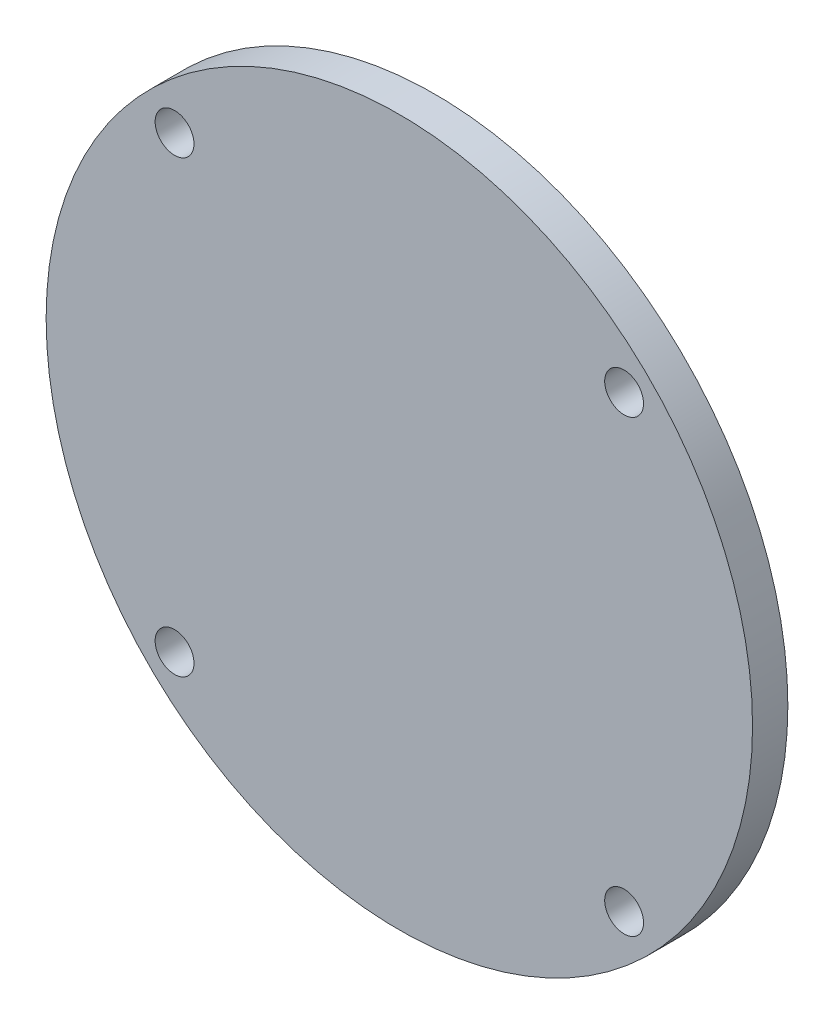
ISO-10303-21;
HEADER;
FILE_DESCRIPTION(('STEP AP214'),'2;1');
FILE_NAME('part.step','',(''),(''),'','','');
FILE_SCHEMA(('AUTOMOTIVE_DESIGN { 1 0 10303 214 1 1 1 1 }'));
ENDSEC;
DATA;
#1=APPLICATION_CONTEXT('core data for automotive mechanical design processes');
#2=APPLICATION_PROTOCOL_DEFINITION('international standard','automotive_design',2000,#1);
#3=PRODUCT_CONTEXT('',#1,'mechanical');
#4=PRODUCT('Part','Part','',(#3));
#5=PRODUCT_RELATED_PRODUCT_CATEGORY('part','',(#4));
#6=PRODUCT_DEFINITION_FORMATION('','',#4);
#7=PRODUCT_DEFINITION_CONTEXT('part definition',#1,'design');
#8=PRODUCT_DEFINITION('design','',#6,#7);
#9=PRODUCT_DEFINITION_SHAPE('','',#8);
#10=(LENGTH_UNIT() NAMED_UNIT(*) SI_UNIT(.MILLI.,.METRE.));
#11=(NAMED_UNIT(*) PLANE_ANGLE_UNIT() SI_UNIT($,.RADIAN.));
#12=(NAMED_UNIT(*) SI_UNIT($,.STERADIAN.) SOLID_ANGLE_UNIT());
#13=UNCERTAINTY_MEASURE_WITH_UNIT(LENGTH_MEASURE(1.E-05),#10,'distance_accuracy_value','');
#14=(GEOMETRIC_REPRESENTATION_CONTEXT(3) GLOBAL_UNCERTAINTY_ASSIGNED_CONTEXT((#13)) GLOBAL_UNIT_ASSIGNED_CONTEXT((#10,
#11,#12)) REPRESENTATION_CONTEXT('',''));
#15=CARTESIAN_POINT('',(0.,0.,0.));
#16=DIRECTION('',(0.,0.,1.));
#17=DIRECTION('',(1.,0.,0.));
#18=AXIS2_PLACEMENT_3D('',#15,#16,#17);
#19=CARTESIAN_POINT('',(0.,0.,-5.));
#20=DIRECTION('',(0.,0.,1.));
#21=DIRECTION('',(1.,0.,0.));
#22=AXIS2_PLACEMENT_3D('',#19,#20,#21);
#23=CYLINDRICAL_SURFACE('',#22,50.);
#24=CARTESIAN_POINT('',(0.,0.,-5.));
#25=DIRECTION('',(0.,0.,1.));
#26=DIRECTION('',(1.,0.,0.));
#27=AXIS2_PLACEMENT_3D('',#24,#25,#26);
#28=CIRCLE('',#27,50.);
#29=CARTESIAN_POINT('',(50.,0.,-5.));
#30=VERTEX_POINT('',#29);
#31=EDGE_CURVE('E10',#30,#30,#28,.T.);
#32=ORIENTED_EDGE('',*,*,#31,.T.);
#33=EDGE_LOOP('',(#32));
#34=FACE_BOUND('',#33,.T.);
#35=CARTESIAN_POINT('',(0.,0.,0.));
#36=DIRECTION('',(0.,0.,1.));
#37=DIRECTION('',(1.,0.,0.));
#38=AXIS2_PLACEMENT_3D('',#35,#36,#37);
#39=CIRCLE('',#38,50.);
#40=CARTESIAN_POINT('',(50.,0.,0.));
#41=VERTEX_POINT('',#40);
#42=EDGE_CURVE('E34',#41,#41,#39,.T.);
#43=ORIENTED_EDGE('',*,*,#42,.F.);
#44=EDGE_LOOP('',(#43));
#45=FACE_BOUND('',#44,.T.);
#46=ADVANCED_FACE('F28',(#34,#45),#23,.T.);
#47=CARTESIAN_POINT('',(0.,0.,-5.));
#48=DIRECTION('',(0.,0.,1.));
#49=DIRECTION('',(1.,0.,0.));
#50=AXIS2_PLACEMENT_3D('',#47,#48,#49);
#51=PLANE('',#50);
#52=CARTESIAN_POINT('',(-31.8198051533946,31.8198051533946,-5.));
#53=DIRECTION('',(0.,0.,1.));
#54=DIRECTION('',(1.,0.,0.));
#55=AXIS2_PLACEMENT_3D('',#52,#53,#54);
#56=CIRCLE('',#55,2.75);
#57=CARTESIAN_POINT('',(-29.0698051533946,31.8198051533946,-5.));
#58=VERTEX_POINT('',#57);
#59=EDGE_CURVE('E59',#58,#58,#56,.T.);
#60=ORIENTED_EDGE('',*,*,#59,.T.);
#61=EDGE_LOOP('',(#60));
#62=FACE_BOUND('',#61,.T.);
#63=CARTESIAN_POINT('',(31.8198051533946,31.8198051533946,-5.));
#64=DIRECTION('',(0.,0.,1.));
#65=DIRECTION('',(1.,0.,0.));
#66=AXIS2_PLACEMENT_3D('',#63,#64,#65);
#67=CIRCLE('',#66,2.75);
#68=CARTESIAN_POINT('',(34.5698051533946,31.8198051533946,-5.));
#69=VERTEX_POINT('',#68);
#70=EDGE_CURVE('E53',#69,#69,#67,.T.);
#71=ORIENTED_EDGE('',*,*,#70,.T.);
#72=EDGE_LOOP('',(#71));
#73=FACE_BOUND('',#72,.T.);
#74=CARTESIAN_POINT('',(31.8198051533946,-31.8198051533946,-5.));
#75=DIRECTION('',(0.,0.,1.));
#76=DIRECTION('',(1.,0.,0.));
#77=AXIS2_PLACEMENT_3D('',#74,#75,#76);
#78=CIRCLE('',#77,2.75);
#79=CARTESIAN_POINT('',(34.5698051533946,-31.8198051533946,-5.));
#80=VERTEX_POINT('',#79);
#81=EDGE_CURVE('E47',#80,#80,#78,.T.);
#82=ORIENTED_EDGE('',*,*,#81,.T.);
#83=EDGE_LOOP('',(#82));
#84=FACE_BOUND('',#83,.T.);
#85=CARTESIAN_POINT('',(-31.8198051533946,-31.8198051533946,-5.));
#86=DIRECTION('',(0.,0.,1.));
#87=DIRECTION('',(1.,0.,0.));
#88=AXIS2_PLACEMENT_3D('',#85,#86,#87);
#89=CIRCLE('',#88,2.75);
#90=CARTESIAN_POINT('',(-29.0698051533946,-31.8198051533946,-5.));
#91=VERTEX_POINT('',#90);
#92=EDGE_CURVE('E38',#91,#91,#89,.T.);
#93=ORIENTED_EDGE('',*,*,#92,.T.);
#94=EDGE_LOOP('',(#93));
#95=FACE_BOUND('',#94,.T.);
#96=ORIENTED_EDGE('',*,*,#31,.F.);
#97=EDGE_LOOP('',(#96));
#98=FACE_BOUND('',#97,.T.);
#99=ADVANCED_FACE('F72',(#62,#73,#84,#95,#98),#51,.F.);
#100=CARTESIAN_POINT('',(0.,0.,0.));
#101=DIRECTION('',(0.,0.,1.));
#102=DIRECTION('',(1.,0.,0.));
#103=AXIS2_PLACEMENT_3D('',#100,#101,#102);
#104=PLANE('',#103);
#105=CARTESIAN_POINT('',(-31.8198051533946,31.8198051533946,0.));
#106=DIRECTION('',(0.,0.,1.));
#107=DIRECTION('',(1.,0.,0.));
#108=AXIS2_PLACEMENT_3D('',#105,#106,#107);
#109=CIRCLE('',#108,2.74999999999999);
#110=CARTESIAN_POINT('',(-29.0698051533946,31.8198051533946,0.));
#111=VERTEX_POINT('',#110);
#112=EDGE_CURVE('E62',#111,#111,#109,.T.);
#113=ORIENTED_EDGE('',*,*,#112,.F.);
#114=EDGE_LOOP('',(#113));
#115=FACE_BOUND('',#114,.T.);
#116=CARTESIAN_POINT('',(31.8198051533946,31.8198051533946,0.));
#117=DIRECTION('',(0.,0.,1.));
#118=DIRECTION('',(1.,0.,0.));
#119=AXIS2_PLACEMENT_3D('',#116,#117,#118);
#120=CIRCLE('',#119,2.74999999999999);
#121=CARTESIAN_POINT('',(34.5698051533946,31.8198051533946,0.));
#122=VERTEX_POINT('',#121);
#123=EDGE_CURVE('E56',#122,#122,#120,.T.);
#124=ORIENTED_EDGE('',*,*,#123,.F.);
#125=EDGE_LOOP('',(#124));
#126=FACE_BOUND('',#125,.T.);
#127=CARTESIAN_POINT('',(31.8198051533946,-31.8198051533946,0.));
#128=DIRECTION('',(0.,0.,1.));
#129=DIRECTION('',(1.,0.,0.));
#130=AXIS2_PLACEMENT_3D('',#127,#128,#129);
#131=CIRCLE('',#130,2.74999999999999);
#132=CARTESIAN_POINT('',(34.5698051533946,-31.8198051533946,0.));
#133=VERTEX_POINT('',#132);
#134=EDGE_CURVE('E50',#133,#133,#131,.T.);
#135=ORIENTED_EDGE('',*,*,#134,.F.);
#136=EDGE_LOOP('',(#135));
#137=FACE_BOUND('',#136,.T.);
#138=CARTESIAN_POINT('',(-31.8198051533946,-31.8198051533946,0.));
#139=DIRECTION('',(0.,0.,1.));
#140=DIRECTION('',(1.,0.,0.));
#141=AXIS2_PLACEMENT_3D('',#138,#139,#140);
#142=CIRCLE('',#141,2.74999999999999);
#143=CARTESIAN_POINT('',(-29.0698051533946,-31.8198051533946,0.));
#144=VERTEX_POINT('',#143);
#145=EDGE_CURVE('E42',#144,#144,#142,.T.);
#146=ORIENTED_EDGE('',*,*,#145,.F.);
#147=EDGE_LOOP('',(#146));
#148=FACE_BOUND('',#147,.T.);
#149=ORIENTED_EDGE('',*,*,#42,.T.);
#150=EDGE_LOOP('',(#149));
#151=FACE_BOUND('',#150,.T.);
#152=ADVANCED_FACE('F68',(#115,#126,#137,#148,#151),#104,.T.);
#153=CARTESIAN_POINT('',(-31.8198051533946,-31.8198051533946,0.));
#154=DIRECTION('',(0.,0.,1.));
#155=DIRECTION('',(1.,0.,0.));
#156=AXIS2_PLACEMENT_3D('',#153,#154,#155);
#157=CYLINDRICAL_SURFACE('',#156,2.74999999999999);
#158=ORIENTED_EDGE('',*,*,#92,.F.);
#159=EDGE_LOOP('',(#158));
#160=FACE_BOUND('',#159,.T.);
#161=ORIENTED_EDGE('',*,*,#145,.T.);
#162=EDGE_LOOP('',(#161));
#163=FACE_BOUND('',#162,.T.);
#164=ADVANCED_FACE('F71',(#160,#163),#157,.F.);
#165=CARTESIAN_POINT('',(31.8198051533946,-31.8198051533946,0.));
#166=DIRECTION('',(0.,0.,1.));
#167=DIRECTION('',(1.,0.,0.));
#168=AXIS2_PLACEMENT_3D('',#165,#166,#167);
#169=CYLINDRICAL_SURFACE('',#168,2.74999999999999);
#170=ORIENTED_EDGE('',*,*,#81,.F.);
#171=EDGE_LOOP('',(#170));
#172=FACE_BOUND('',#171,.T.);
#173=ORIENTED_EDGE('',*,*,#134,.T.);
#174=EDGE_LOOP('',(#173));
#175=FACE_BOUND('',#174,.T.);
#176=ADVANCED_FACE('F81',(#172,#175),#169,.F.);
#177=CARTESIAN_POINT('',(31.8198051533946,31.8198051533946,0.));
#178=DIRECTION('',(0.,0.,1.));
#179=DIRECTION('',(1.,0.,0.));
#180=AXIS2_PLACEMENT_3D('',#177,#178,#179);
#181=CYLINDRICAL_SURFACE('',#180,2.74999999999999);
#182=ORIENTED_EDGE('',*,*,#70,.F.);
#183=EDGE_LOOP('',(#182));
#184=FACE_BOUND('',#183,.T.);
#185=ORIENTED_EDGE('',*,*,#123,.T.);
#186=EDGE_LOOP('',(#185));
#187=FACE_BOUND('',#186,.T.);
#188=ADVANCED_FACE('F87',(#184,#187),#181,.F.);
#189=CARTESIAN_POINT('',(-31.8198051533946,31.8198051533946,0.));
#190=DIRECTION('',(0.,0.,1.));
#191=DIRECTION('',(1.,0.,0.));
#192=AXIS2_PLACEMENT_3D('',#189,#190,#191);
#193=CYLINDRICAL_SURFACE('',#192,2.74999999999999);
#194=ORIENTED_EDGE('',*,*,#59,.F.);
#195=EDGE_LOOP('',(#194));
#196=FACE_BOUND('',#195,.T.);
#197=ORIENTED_EDGE('',*,*,#112,.T.);
#198=EDGE_LOOP('',(#197));
#199=FACE_BOUND('',#198,.T.);
#200=ADVANCED_FACE('F66',(#196,#199),#193,.F.);
#201=CLOSED_SHELL('',(#46,#99,#152,#164,#176,#188,#200));
#202=MANIFOLD_SOLID_BREP('B2',#201);
#203=ADVANCED_BREP_SHAPE_REPRESENTATION('',(#18,#202),#14);
#204=SHAPE_DEFINITION_REPRESENTATION(#9,#203);
ENDSEC;
END-ISO-10303-21;
